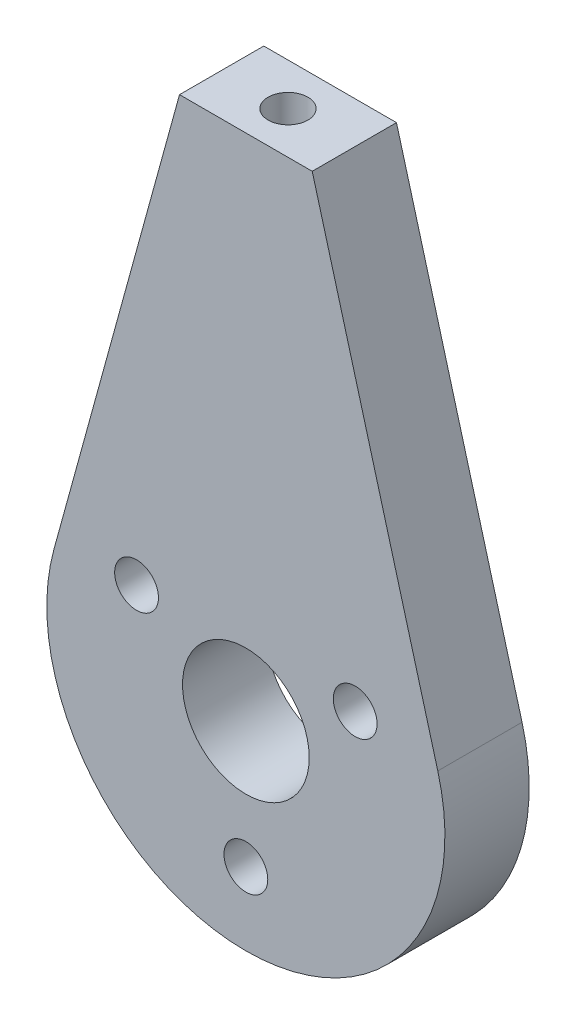
ISO-10303-21;
HEADER;
FILE_DESCRIPTION(('STEP AP214'),'2;1');
FILE_NAME('part.step','',(''),(''),'','','');
FILE_SCHEMA(('AUTOMOTIVE_DESIGN { 1 0 10303 214 1 1 1 1 }'));
ENDSEC;
DATA;
#1=APPLICATION_CONTEXT('core data for automotive mechanical design processes');
#2=APPLICATION_PROTOCOL_DEFINITION('international standard','automotive_design',2000,#1);
#3=PRODUCT_CONTEXT('',#1,'mechanical');
#4=PRODUCT('Part','Part','',(#3));
#5=PRODUCT_RELATED_PRODUCT_CATEGORY('part','',(#4));
#6=PRODUCT_DEFINITION_FORMATION('','',#4);
#7=PRODUCT_DEFINITION_CONTEXT('part definition',#1,'design');
#8=PRODUCT_DEFINITION('design','',#6,#7);
#9=PRODUCT_DEFINITION_SHAPE('','',#8);
#10=(LENGTH_UNIT() NAMED_UNIT(*) SI_UNIT(.MILLI.,.METRE.));
#11=(NAMED_UNIT(*) PLANE_ANGLE_UNIT() SI_UNIT($,.RADIAN.));
#12=(NAMED_UNIT(*) SI_UNIT($,.STERADIAN.) SOLID_ANGLE_UNIT());
#13=UNCERTAINTY_MEASURE_WITH_UNIT(LENGTH_MEASURE(1.E-05),#10,'distance_accuracy_value','');
#14=(GEOMETRIC_REPRESENTATION_CONTEXT(3) GLOBAL_UNCERTAINTY_ASSIGNED_CONTEXT((#13)) GLOBAL_UNIT_ASSIGNED_CONTEXT((#10,
#11,#12)) REPRESENTATION_CONTEXT('',''));
#15=CARTESIAN_POINT('',(0.,0.,0.));
#16=DIRECTION('',(0.,0.,1.));
#17=DIRECTION('',(1.,0.,0.));
#18=AXIS2_PLACEMENT_3D('',#15,#16,#17);
#19=CARTESIAN_POINT('',(-14.4628281295073,3.97826626765148,3.175));
#20=DIRECTION('',(0.964188541967151,-0.265217751176765,0.));
#21=DIRECTION('',(0.265217751176765,0.964188541967151,0.));
#22=AXIS2_PLACEMENT_3D('',#19,#20,#21);
#23=PLANE('',#22);
#24=DIRECTION('',(-0.265217751176765,-0.964188541967151,0.));
#25=VECTOR('',#24,1.);
#26=CARTESIAN_POINT('',(-14.4628281295073,3.97826626765148,-3.175));
#27=LINE('',#26,#25);
#28=CARTESIAN_POINT('',(-5.,38.38,-3.175));
#29=VERTEX_POINT('',#28);
#30=CARTESIAN_POINT('',(-14.4628281295073,3.97826626765148,-3.175));
#31=VERTEX_POINT('',#30);
#32=EDGE_CURVE('E117',#29,#31,#27,.T.);
#33=ORIENTED_EDGE('',*,*,#32,.T.);
#34=DIRECTION('',(0.,0.,-1.));
#35=VECTOR('',#34,1.);
#36=CARTESIAN_POINT('',(-14.4628281295073,3.97826626765148,3.175));
#37=LINE('',#36,#35);
#38=CARTESIAN_POINT('',(-14.4628281295073,3.97826626765148,3.175));
#39=VERTEX_POINT('',#38);
#40=EDGE_CURVE('E11',#39,#31,#37,.T.);
#41=ORIENTED_EDGE('',*,*,#40,.F.);
#42=DIRECTION('',(-0.265217751176765,-0.964188541967151,0.));
#43=VECTOR('',#42,1.);
#44=CARTESIAN_POINT('',(-14.4628281295073,3.97826626765148,3.175));
#45=LINE('',#44,#43);
#46=CARTESIAN_POINT('',(-5.,38.38,3.175));
#47=VERTEX_POINT('',#46);
#48=EDGE_CURVE('E99',#47,#39,#45,.T.);
#49=ORIENTED_EDGE('',*,*,#48,.F.);
#50=DIRECTION('',(0.,0.,-1.));
#51=VECTOR('',#50,1.);
#52=CARTESIAN_POINT('',(-5.,38.38,3.175));
#53=LINE('',#52,#51);
#54=EDGE_CURVE('E66',#47,#29,#53,.T.);
#55=ORIENTED_EDGE('',*,*,#54,.T.);
#56=EDGE_LOOP('',(#33,#41,#49,#55));
#57=FACE_BOUND('',#56,.T.);
#58=ADVANCED_FACE('F49',(#57),#23,.F.);
#59=CARTESIAN_POINT('',(0.,0.,3.175));
#60=DIRECTION('',(0.,0.,-1.));
#61=DIRECTION('',(-1.,0.,0.));
#62=AXIS2_PLACEMENT_3D('',#59,#60,#61);
#63=CYLINDRICAL_SURFACE('',#62,15.);
#64=CARTESIAN_POINT('',(0.,0.,-3.175));
#65=DIRECTION('',(0.,0.,1.));
#66=DIRECTION('',(1.,0.,0.));
#67=AXIS2_PLACEMENT_3D('',#64,#65,#66);
#68=CIRCLE('',#67,15.);
#69=CARTESIAN_POINT('',(14.4628281295073,3.97826626765148,-3.175));
#70=VERTEX_POINT('',#69);
#71=EDGE_CURVE('E105',#31,#70,#68,.T.);
#72=ORIENTED_EDGE('',*,*,#71,.T.);
#73=DIRECTION('',(0.,0.,-1.));
#74=VECTOR('',#73,1.);
#75=CARTESIAN_POINT('',(14.4628281295073,3.97826626765148,3.175));
#76=LINE('',#75,#74);
#77=CARTESIAN_POINT('',(14.4628281295073,3.97826626765148,3.175));
#78=VERTEX_POINT('',#77);
#79=EDGE_CURVE('E58',#78,#70,#76,.T.);
#80=ORIENTED_EDGE('',*,*,#79,.F.);
#81=CARTESIAN_POINT('',(0.,0.,3.175));
#82=DIRECTION('',(0.,0.,1.));
#83=DIRECTION('',(1.,0.,0.));
#84=AXIS2_PLACEMENT_3D('',#81,#82,#83);
#85=CIRCLE('',#84,15.);
#86=EDGE_CURVE('E91',#39,#78,#85,.T.);
#87=ORIENTED_EDGE('',*,*,#86,.F.);
#88=ORIENTED_EDGE('',*,*,#40,.T.);
#89=EDGE_LOOP('',(#72,#80,#87,#88));
#90=FACE_BOUND('',#89,.T.);
#91=ADVANCED_FACE('F104',(#90),#63,.T.);
#92=CARTESIAN_POINT('',(14.4628281295073,3.97826626765148,3.175));
#93=DIRECTION('',(0.964188541967151,0.265217751176765,0.));
#94=DIRECTION('',(-0.265217751176765,0.964188541967151,0.));
#95=AXIS2_PLACEMENT_3D('',#92,#93,#94);
#96=PLANE('',#95);
#97=DIRECTION('',(0.265217751176765,-0.964188541967151,0.));
#98=VECTOR('',#97,1.);
#99=CARTESIAN_POINT('',(14.4628281295073,3.97826626765148,-3.175));
#100=LINE('',#99,#98);
#101=CARTESIAN_POINT('',(5.,38.38,-3.175));
#102=VERTEX_POINT('',#101);
#103=EDGE_CURVE('E123',#102,#70,#100,.T.);
#104=ORIENTED_EDGE('',*,*,#103,.F.);
#105=DIRECTION('',(0.,0.,-1.));
#106=VECTOR('',#105,1.);
#107=CARTESIAN_POINT('',(5.,38.38,3.175));
#108=LINE('',#107,#106);
#109=CARTESIAN_POINT('',(5.,38.38,3.175));
#110=VERTEX_POINT('',#109);
#111=EDGE_CURVE('E80',#110,#102,#108,.T.);
#112=ORIENTED_EDGE('',*,*,#111,.F.);
#113=DIRECTION('',(0.265217751176765,-0.964188541967151,0.));
#114=VECTOR('',#113,1.);
#115=CARTESIAN_POINT('',(14.4628281295073,3.97826626765148,3.175));
#116=LINE('',#115,#114);
#117=EDGE_CURVE('E98',#110,#78,#116,.T.);
#118=ORIENTED_EDGE('',*,*,#117,.T.);
#119=ORIENTED_EDGE('',*,*,#79,.T.);
#120=EDGE_LOOP('',(#104,#112,#118,#119));
#121=FACE_BOUND('',#120,.T.);
#122=ADVANCED_FACE('F109',(#121),#96,.T.);
#123=CARTESIAN_POINT('',(0.,38.38,3.175));
#124=DIRECTION('',(0.,1.,0.));
#125=DIRECTION('',(0.,0.,1.));
#126=AXIS2_PLACEMENT_3D('',#123,#124,#125);
#127=PLANE('',#126);
#128=CARTESIAN_POINT('',(0.,38.38,0.));
#129=DIRECTION('',(0.,1.,0.));
#130=DIRECTION('',(0.,0.,1.));
#131=AXIS2_PLACEMENT_3D('',#128,#129,#130);
#132=CIRCLE('',#131,1.5);
#133=CARTESIAN_POINT('',(0.,38.38,1.5));
#134=VERTEX_POINT('',#133);
#135=EDGE_CURVE('E144',#134,#134,#132,.T.);
#136=ORIENTED_EDGE('',*,*,#135,.F.);
#137=EDGE_LOOP('',(#136));
#138=FACE_BOUND('',#137,.T.);
#139=DIRECTION('',(1.,0.,0.));
#140=VECTOR('',#139,1.);
#141=CARTESIAN_POINT('',(0.,38.38,-3.175));
#142=LINE('',#141,#140);
#143=EDGE_CURVE('E126',#29,#102,#142,.T.);
#144=ORIENTED_EDGE('',*,*,#143,.F.);
#145=ORIENTED_EDGE('',*,*,#54,.F.);
#146=DIRECTION('',(1.,0.,0.));
#147=VECTOR('',#146,1.);
#148=CARTESIAN_POINT('',(0.,38.38,3.175));
#149=LINE('',#148,#147);
#150=EDGE_CURVE('E111',#47,#110,#149,.T.);
#151=ORIENTED_EDGE('',*,*,#150,.T.);
#152=ORIENTED_EDGE('',*,*,#111,.T.);
#153=EDGE_LOOP('',(#144,#145,#151,#152));
#154=FACE_BOUND('',#153,.T.);
#155=ADVANCED_FACE('F188',(#138,#154),#127,.T.);
#156=CARTESIAN_POINT('',(0.,0.,3.175));
#157=DIRECTION('',(0.,0.,1.));
#158=DIRECTION('',(1.,0.,0.));
#159=AXIS2_PLACEMENT_3D('',#156,#157,#158);
#160=PLANE('',#159);
#161=CARTESIAN_POINT('',(0.,-9.5125,3.175));
#162=DIRECTION('',(0.,0.,1.));
#163=DIRECTION('',(1.,0.,0.));
#164=AXIS2_PLACEMENT_3D('',#161,#162,#163);
#165=CIRCLE('',#164,1.65);
#166=CARTESIAN_POINT('',(1.65,-9.5125,3.175));
#167=VERTEX_POINT('',#166);
#168=EDGE_CURVE('E168',#167,#167,#165,.T.);
#169=ORIENTED_EDGE('',*,*,#168,.F.);
#170=EDGE_LOOP('',(#169));
#171=FACE_BOUND('',#170,.T.);
#172=CARTESIAN_POINT('',(-8.23806665349947,4.75625,3.175));
#173=DIRECTION('',(0.,0.,1.));
#174=DIRECTION('',(1.,0.,0.));
#175=AXIS2_PLACEMENT_3D('',#172,#173,#174);
#176=CIRCLE('',#175,1.65);
#177=CARTESIAN_POINT('',(-6.58806665349947,4.75625,3.175));
#178=VERTEX_POINT('',#177);
#179=EDGE_CURVE('E164',#178,#178,#176,.T.);
#180=ORIENTED_EDGE('',*,*,#179,.F.);
#181=EDGE_LOOP('',(#180));
#182=FACE_BOUND('',#181,.T.);
#183=CARTESIAN_POINT('',(8.23806665349947,4.75625,3.175));
#184=DIRECTION('',(0.,0.,1.));
#185=DIRECTION('',(1.,0.,0.));
#186=AXIS2_PLACEMENT_3D('',#183,#184,#185);
#187=CIRCLE('',#186,1.65);
#188=CARTESIAN_POINT('',(9.88806665349947,4.75625,3.175));
#189=VERTEX_POINT('',#188);
#190=EDGE_CURVE('E156',#189,#189,#187,.T.);
#191=ORIENTED_EDGE('',*,*,#190,.F.);
#192=EDGE_LOOP('',(#191));
#193=FACE_BOUND('',#192,.T.);
#194=CARTESIAN_POINT('',(0.,0.,3.175));
#195=DIRECTION('',(0.,0.,1.));
#196=DIRECTION('',(1.,0.,0.));
#197=AXIS2_PLACEMENT_3D('',#194,#195,#196);
#198=CIRCLE('',#197,4.77266);
#199=CARTESIAN_POINT('',(4.77266,0.,3.175));
#200=VERTEX_POINT('',#199);
#201=EDGE_CURVE('E136',#200,#200,#198,.T.);
#202=ORIENTED_EDGE('',*,*,#201,.F.);
#203=EDGE_LOOP('',(#202));
#204=FACE_BOUND('',#203,.T.);
#205=ORIENTED_EDGE('',*,*,#48,.T.);
#206=ORIENTED_EDGE('',*,*,#86,.T.);
#207=ORIENTED_EDGE('',*,*,#117,.F.);
#208=ORIENTED_EDGE('',*,*,#150,.F.);
#209=EDGE_LOOP('',(#205,#206,#207,#208));
#210=FACE_BOUND('',#209,.T.);
#211=ADVANCED_FACE('F95',(#171,#182,#193,#204,#210),#160,.T.);
#212=CARTESIAN_POINT('',(0.,0.,-3.175));
#213=DIRECTION('',(0.,0.,1.));
#214=DIRECTION('',(1.,0.,0.));
#215=AXIS2_PLACEMENT_3D('',#212,#213,#214);
#216=PLANE('',#215);
#217=CARTESIAN_POINT('',(0.,-9.5125,-3.175));
#218=DIRECTION('',(0.,0.,1.));
#219=DIRECTION('',(1.,0.,0.));
#220=AXIS2_PLACEMENT_3D('',#217,#218,#219);
#221=CIRCLE('',#220,1.65);
#222=CARTESIAN_POINT('',(1.65,-9.5125,-3.175));
#223=VERTEX_POINT('',#222);
#224=EDGE_CURVE('E148',#223,#223,#221,.T.);
#225=ORIENTED_EDGE('',*,*,#224,.T.);
#226=EDGE_LOOP('',(#225));
#227=FACE_BOUND('',#226,.T.);
#228=CARTESIAN_POINT('',(-8.23806665349947,4.75625,-3.175));
#229=DIRECTION('',(0.,0.,1.));
#230=DIRECTION('',(1.,0.,0.));
#231=AXIS2_PLACEMENT_3D('',#228,#229,#230);
#232=CIRCLE('',#231,1.65);
#233=CARTESIAN_POINT('',(-6.58806665349947,4.75625,-3.175));
#234=VERTEX_POINT('',#233);
#235=EDGE_CURVE('E160',#234,#234,#232,.T.);
#236=ORIENTED_EDGE('',*,*,#235,.T.);
#237=EDGE_LOOP('',(#236));
#238=FACE_BOUND('',#237,.T.);
#239=CARTESIAN_POINT('',(8.23806665349947,4.75625,-3.175));
#240=DIRECTION('',(0.,0.,1.));
#241=DIRECTION('',(1.,0.,0.));
#242=AXIS2_PLACEMENT_3D('',#239,#240,#241);
#243=CIRCLE('',#242,1.65);
#244=CARTESIAN_POINT('',(9.88806665349947,4.75625,-3.175));
#245=VERTEX_POINT('',#244);
#246=EDGE_CURVE('E152',#245,#245,#243,.T.);
#247=ORIENTED_EDGE('',*,*,#246,.T.);
#248=EDGE_LOOP('',(#247));
#249=FACE_BOUND('',#248,.T.);
#250=CARTESIAN_POINT('',(0.,0.,-3.175));
#251=DIRECTION('',(0.,0.,1.));
#252=DIRECTION('',(1.,0.,0.));
#253=AXIS2_PLACEMENT_3D('',#250,#251,#252);
#254=CIRCLE('',#253,4.77266);
#255=CARTESIAN_POINT('',(4.77266,0.,-3.175));
#256=VERTEX_POINT('',#255);
#257=EDGE_CURVE('E120',#256,#256,#254,.T.);
#258=ORIENTED_EDGE('',*,*,#257,.T.);
#259=EDGE_LOOP('',(#258));
#260=FACE_BOUND('',#259,.T.);
#261=ORIENTED_EDGE('',*,*,#32,.F.);
#262=ORIENTED_EDGE('',*,*,#143,.T.);
#263=ORIENTED_EDGE('',*,*,#103,.T.);
#264=ORIENTED_EDGE('',*,*,#71,.F.);
#265=EDGE_LOOP('',(#261,#262,#263,#264));
#266=FACE_BOUND('',#265,.T.);
#267=ADVANCED_FACE('F176',(#227,#238,#249,#260,#266),#216,.F.);
#268=CARTESIAN_POINT('',(0.,0.,-3.175));
#269=DIRECTION('',(0.,0.,1.));
#270=DIRECTION('',(1.,0.,0.));
#271=AXIS2_PLACEMENT_3D('',#268,#269,#270);
#272=CYLINDRICAL_SURFACE('',#271,4.77266);
#273=ORIENTED_EDGE('',*,*,#257,.F.);
#274=EDGE_LOOP('',(#273));
#275=FACE_BOUND('',#274,.T.);
#276=ORIENTED_EDGE('',*,*,#201,.T.);
#277=EDGE_LOOP('',(#276));
#278=FACE_BOUND('',#277,.T.);
#279=ADVANCED_FACE('F196',(#275,#278),#272,.F.);
#280=CARTESIAN_POINT('',(0.,24.38,0.));
#281=DIRECTION('',(0.,1.,0.));
#282=DIRECTION('',(0.,0.,1.));
#283=AXIS2_PLACEMENT_3D('',#280,#281,#282);
#284=CYLINDRICAL_SURFACE('',#283,1.5);
#285=CARTESIAN_POINT('',(0.,24.38,0.));
#286=DIRECTION('',(0.,1.,0.));
#287=DIRECTION('',(0.,0.,1.));
#288=AXIS2_PLACEMENT_3D('',#285,#286,#287);
#289=CIRCLE('',#288,1.5);
#290=CARTESIAN_POINT('',(0.,24.38,1.5));
#291=VERTEX_POINT('',#290);
#292=EDGE_CURVE('E140',#291,#291,#289,.T.);
#293=ORIENTED_EDGE('',*,*,#292,.F.);
#294=EDGE_LOOP('',(#293));
#295=FACE_BOUND('',#294,.T.);
#296=ORIENTED_EDGE('',*,*,#135,.T.);
#297=EDGE_LOOP('',(#296));
#298=FACE_BOUND('',#297,.T.);
#299=ADVANCED_FACE('F198',(#295,#298),#284,.F.);
#300=CARTESIAN_POINT('',(0.,24.38,0.));
#301=DIRECTION('',(0.,1.,0.));
#302=DIRECTION('',(0.,0.,1.));
#303=AXIS2_PLACEMENT_3D('',#300,#301,#302);
#304=PLANE('',#303);
#305=ORIENTED_EDGE('',*,*,#292,.T.);
#306=EDGE_LOOP('',(#305));
#307=FACE_BOUND('',#306,.T.);
#308=ADVANCED_FACE('F206',(#307),#304,.T.);
#309=CARTESIAN_POINT('',(8.23806665349947,4.75625,-3.175));
#310=DIRECTION('',(0.,0.,1.));
#311=DIRECTION('',(1.,0.,0.));
#312=AXIS2_PLACEMENT_3D('',#309,#310,#311);
#313=CYLINDRICAL_SURFACE('',#312,1.65);
#314=ORIENTED_EDGE('',*,*,#246,.F.);
#315=EDGE_LOOP('',(#314));
#316=FACE_BOUND('',#315,.T.);
#317=ORIENTED_EDGE('',*,*,#190,.T.);
#318=EDGE_LOOP('',(#317));
#319=FACE_BOUND('',#318,.T.);
#320=ADVANCED_FACE('F269',(#316,#319),#313,.F.);
#321=CARTESIAN_POINT('',(-8.23806665349947,4.75625,-3.175));
#322=DIRECTION('',(0.,0.,1.));
#323=DIRECTION('',(1.,0.,0.));
#324=AXIS2_PLACEMENT_3D('',#321,#322,#323);
#325=CYLINDRICAL_SURFACE('',#324,1.65);
#326=ORIENTED_EDGE('',*,*,#235,.F.);
#327=EDGE_LOOP('',(#326));
#328=FACE_BOUND('',#327,.T.);
#329=ORIENTED_EDGE('',*,*,#179,.T.);
#330=EDGE_LOOP('',(#329));
#331=FACE_BOUND('',#330,.T.);
#332=ADVANCED_FACE('F182',(#328,#331),#325,.F.);
#333=CARTESIAN_POINT('',(0.,-9.5125,-3.175));
#334=DIRECTION('',(0.,0.,1.));
#335=DIRECTION('',(1.,0.,0.));
#336=AXIS2_PLACEMENT_3D('',#333,#334,#335);
#337=CYLINDRICAL_SURFACE('',#336,1.65);
#338=ORIENTED_EDGE('',*,*,#224,.F.);
#339=EDGE_LOOP('',(#338));
#340=FACE_BOUND('',#339,.T.);
#341=ORIENTED_EDGE('',*,*,#168,.T.);
#342=EDGE_LOOP('',(#341));
#343=FACE_BOUND('',#342,.T.);
#344=ADVANCED_FACE('F179',(#340,#343),#337,.F.);
#345=CLOSED_SHELL('',(#58,#91,#122,#155,#211,#267,#279,#299,#308,#320,#332,#344));
#346=MANIFOLD_SOLID_BREP('B2',#345);
#347=ADVANCED_BREP_SHAPE_REPRESENTATION('',(#18,#346),#14);
#348=SHAPE_DEFINITION_REPRESENTATION(#9,#347);
ENDSEC;
END-ISO-10303-21;
